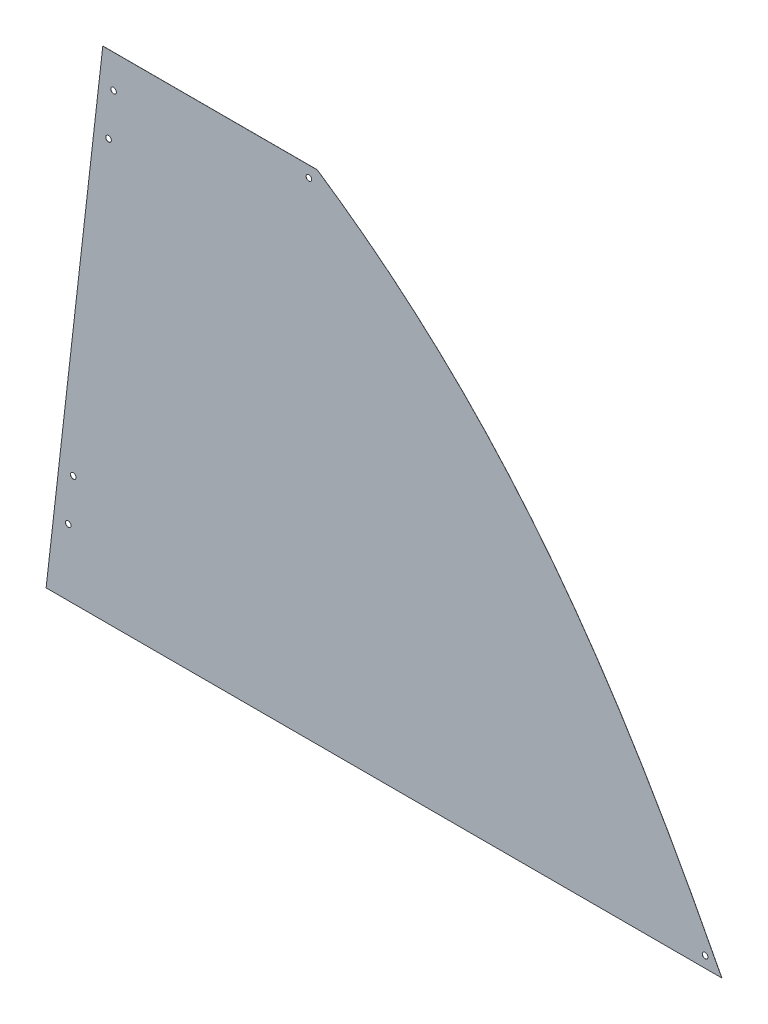
ISO-10303-21;
HEADER;
FILE_DESCRIPTION(('STEP AP214'),'2;1');
FILE_NAME('part.step','',(''),(''),'','','');
FILE_SCHEMA(('AUTOMOTIVE_DESIGN { 1 0 10303 214 1 1 1 1 }'));
ENDSEC;
DATA;
#1=APPLICATION_CONTEXT('core data for automotive mechanical design processes');
#2=APPLICATION_PROTOCOL_DEFINITION('international standard','automotive_design',2000,#1);
#3=PRODUCT_CONTEXT('',#1,'mechanical');
#4=PRODUCT('Part','Part','',(#3));
#5=PRODUCT_RELATED_PRODUCT_CATEGORY('part','',(#4));
#6=PRODUCT_DEFINITION_FORMATION('','',#4);
#7=PRODUCT_DEFINITION_CONTEXT('part definition',#1,'design');
#8=PRODUCT_DEFINITION('design','',#6,#7);
#9=PRODUCT_DEFINITION_SHAPE('','',#8);
#10=(LENGTH_UNIT() NAMED_UNIT(*) SI_UNIT(.MILLI.,.METRE.));
#11=(NAMED_UNIT(*) PLANE_ANGLE_UNIT() SI_UNIT($,.RADIAN.));
#12=(NAMED_UNIT(*) SI_UNIT($,.STERADIAN.) SOLID_ANGLE_UNIT());
#13=UNCERTAINTY_MEASURE_WITH_UNIT(LENGTH_MEASURE(1.E-05),#10,'distance_accuracy_value','');
#14=(GEOMETRIC_REPRESENTATION_CONTEXT(3) GLOBAL_UNCERTAINTY_ASSIGNED_CONTEXT((#13)) GLOBAL_UNIT_ASSIGNED_CONTEXT((#10,
#11,#12)) REPRESENTATION_CONTEXT('',''));
#15=CARTESIAN_POINT('',(0.,0.,0.));
#16=DIRECTION('',(0.,0.,1.));
#17=DIRECTION('',(1.,0.,0.));
#18=AXIS2_PLACEMENT_3D('',#15,#16,#17);
#19=CARTESIAN_POINT('',(546.176583356864,314.686016228379,0.));
#20=DIRECTION('',(0.,0.,1.));
#21=DIRECTION('',(1.,0.,0.));
#22=AXIS2_PLACEMENT_3D('',#19,#20,#21);
#23=PLANE('',#22);
#24=CARTESIAN_POINT('',(720.09,12.7,0.));
#25=DIRECTION('',(0.,0.,1.));
#26=DIRECTION('',(1.,0.,0.));
#27=AXIS2_PLACEMENT_3D('',#24,#25,#26);
#28=CIRCLE('',#27,3.17500000000004);
#29=CARTESIAN_POINT('',(723.265,12.7,0.));
#30=VERTEX_POINT('',#29);
#31=EDGE_CURVE('E149',#30,#30,#28,.T.);
#32=ORIENTED_EDGE('',*,*,#31,.T.);
#33=EDGE_LOOP('',(#32));
#34=FACE_BOUND('',#33,.T.);
#35=CARTESIAN_POINT('',(267.895636668357,555.12631551917,0.));
#36=DIRECTION('',(0.,0.,1.));
#37=DIRECTION('',(1.,0.,0.));
#38=AXIS2_PLACEMENT_3D('',#35,#36,#37);
#39=CIRCLE('',#38,3.17499999999998);
#40=CARTESIAN_POINT('',(271.070636668357,555.12631551917,0.));
#41=VERTEX_POINT('',#40);
#42=EDGE_CURVE('E159',#41,#41,#39,.T.);
#43=ORIENTED_EDGE('',*,*,#42,.T.);
#44=EDGE_LOOP('',(#43));
#45=FACE_BOUND('',#44,.T.);
#46=CARTESIAN_POINT('',(-0.961790577808013,126.183625670927,0.));
#47=DIRECTION('',(0.,0.,1.));
#48=DIRECTION('',(1.,0.,0.));
#49=AXIS2_PLACEMENT_3D('',#46,#47,#48);
#50=CIRCLE('',#49,3.17499999999999);
#51=CARTESIAN_POINT('',(2.21320942219198,126.183625670927,0.));
#52=VERTEX_POINT('',#51);
#53=EDGE_CURVE('E169',#52,#52,#50,.F.);
#54=ORIENTED_EDGE('',*,*,#53,.F.);
#55=EDGE_LOOP('',(#54));
#56=FACE_BOUND('',#55,.T.);
#57=CARTESIAN_POINT('',(39.2932722380583,479.497777549522,0.));
#58=DIRECTION('',(0.,0.,1.));
#59=DIRECTION('',(1.,0.,0.));
#60=AXIS2_PLACEMENT_3D('',#57,#58,#59);
#61=CIRCLE('',#60,3.17499999999999);
#62=CARTESIAN_POINT('',(42.4682722380583,479.497777549522,0.));
#63=VERTEX_POINT('',#62);
#64=EDGE_CURVE('E175',#63,#63,#61,.F.);
#65=ORIENTED_EDGE('',*,*,#64,.F.);
#66=EDGE_LOOP('',(#65));
#67=FACE_BOUND('',#66,.T.);
#68=CARTESIAN_POINT('',(45.0439954974677,529.971227817892,0.));
#69=DIRECTION('',(0.,0.,1.));
#70=DIRECTION('',(1.,0.,0.));
#71=AXIS2_PLACEMENT_3D('',#68,#69,#70);
#72=CIRCLE('',#71,3.17499999999999);
#73=CARTESIAN_POINT('',(48.2189954974677,529.971227817892,0.));
#74=VERTEX_POINT('',#73);
#75=EDGE_CURVE('E94',#74,#74,#72,.F.);
#76=ORIENTED_EDGE('',*,*,#75,.F.);
#77=EDGE_LOOP('',(#76));
#78=FACE_BOUND('',#77,.T.);
#79=DIRECTION('',(1.,0.,0.));
#80=VECTOR('',#79,1.);
#81=CARTESIAN_POINT('',(0.,0.,0.));
#82=LINE('',#81,#80);
#83=CARTESIAN_POINT('',(-31.9554140131912,0.,0.));
#84=VERTEX_POINT('',#83);
#85=CARTESIAN_POINT('',(739.14,0.,0.));
#86=VERTEX_POINT('',#85);
#87=EDGE_CURVE('E60',#84,#86,#82,.T.);
#88=ORIENTED_EDGE('',*,*,#87,.F.);
#89=DIRECTION('',(0.113203213767903,0.993571855676588,0.));
#90=VECTOR('',#89,1.);
#91=CARTESIAN_POINT('',(32.7402226551654,567.82631551917,0.));
#92=LINE('',#91,#90);
#93=CARTESIAN_POINT('',(32.7402226551654,567.82631551917,0.));
#94=VERTEX_POINT('',#93);
#95=EDGE_CURVE('E92',#84,#94,#92,.T.);
#96=ORIENTED_EDGE('',*,*,#95,.T.);
#97=DIRECTION('',(-1.,0.,0.));
#98=VECTOR('',#97,1.);
#99=CARTESIAN_POINT('',(64.6956366683566,567.82631551917,0.));
#100=LINE('',#99,#98);
#101=CARTESIAN_POINT('',(277.420636668357,567.82631551917,0.));
#102=VERTEX_POINT('',#101);
#103=EDGE_CURVE('E69',#102,#94,#100,.T.);
#104=ORIENTED_EDGE('',*,*,#103,.F.);
#105=CARTESIAN_POINT('',(739.14,0.,0.));
#106=CARTESIAN_POINT('',(620.758181584613,229.590161118797,0.));
#107=CARTESIAN_POINT('',(496.859161810905,420.297110317156,0.));
#108=CARTESIAN_POINT('',(277.420636668357,567.82631551917,0.));
#109=B_SPLINE_CURVE_WITH_KNOTS('',3,(#105,#106,#107,#108),.UNSPECIFIED.,.F.,.F.,(4,4),(0.,1.),.UNSPECIFIED.);
#110=EDGE_CURVE('E202',#86,#102,#109,.T.);
#111=ORIENTED_EDGE('',*,*,#110,.F.);
#112=EDGE_LOOP('',(#88,#96,#104,#111));
#113=FACE_BOUND('',#112,.T.);
#114=CARTESIAN_POINT('',(-6.71251383721748,75.710175402556,0.));
#115=DIRECTION('',(0.,0.,1.));
#116=DIRECTION('',(1.,0.,0.));
#117=AXIS2_PLACEMENT_3D('',#114,#115,#116);
#118=CIRCLE('',#117,3.17499999999999);
#119=CARTESIAN_POINT('',(-3.53751383721748,75.710175402556,0.));
#120=VERTEX_POINT('',#119);
#121=EDGE_CURVE('E163',#120,#120,#118,.F.);
#122=ORIENTED_EDGE('',*,*,#121,.F.);
#123=EDGE_LOOP('',(#122));
#124=FACE_BOUND('',#123,.T.);
#125=ADVANCED_FACE('F32',(#34,#45,#56,#67,#78,#113,#124),#23,.F.);
#126=CARTESIAN_POINT('',(0.,0.,0.127));
#127=DIRECTION('',(0.,1.,0.));
#128=DIRECTION('',(0.,0.,1.));
#129=AXIS2_PLACEMENT_3D('',#126,#127,#128);
#130=PLANE('',#129);
#131=ORIENTED_EDGE('',*,*,#87,.T.);
#132=DIRECTION('',(0.,0.,-1.));
#133=VECTOR('',#132,1.);
#134=CARTESIAN_POINT('',(739.14,0.,0.127));
#135=LINE('',#134,#133);
#136=CARTESIAN_POINT('',(739.14,0.,0.127));
#137=VERTEX_POINT('',#136);
#138=EDGE_CURVE('E11',#137,#86,#135,.T.);
#139=ORIENTED_EDGE('',*,*,#138,.F.);
#140=DIRECTION('',(1.,0.,0.));
#141=VECTOR('',#140,1.);
#142=CARTESIAN_POINT('',(0.,0.,0.127));
#143=LINE('',#142,#141);
#144=CARTESIAN_POINT('',(-31.9554140131912,0.,0.126999999999988));
#145=VERTEX_POINT('',#144);
#146=EDGE_CURVE('E79',#145,#137,#143,.T.);
#147=ORIENTED_EDGE('',*,*,#146,.F.);
#148=DIRECTION('',(0.,0.,-1.));
#149=VECTOR('',#148,1.);
#150=CARTESIAN_POINT('',(-31.9554140131912,0.,576.120185891919));
#151=LINE('',#150,#149);
#152=EDGE_CURVE('E81',#145,#84,#151,.T.);
#153=ORIENTED_EDGE('',*,*,#152,.T.);
#154=EDGE_LOOP('',(#131,#139,#147,#153));
#155=FACE_BOUND('',#154,.T.);
#156=ADVANCED_FACE('F34',(#155),#130,.F.);
#157=CARTESIAN_POINT('',(739.14,0.,0.127));
#158=CARTESIAN_POINT('',(620.758181584613,229.590161118797,0.127));
#159=CARTESIAN_POINT('',(496.859161810905,420.297110317156,0.127));
#160=CARTESIAN_POINT('',(277.420636668357,567.82631551917,0.127));
#161=B_SPLINE_CURVE_WITH_KNOTS('',3,(#157,#158,#159,#160),.UNSPECIFIED.,.F.,.F.,(4,4),(0.,1.),.UNSPECIFIED.);
#162=DIRECTION('',(0.,0.,-1.));
#163=VECTOR('',#162,1.);
#164=SURFACE_OF_LINEAR_EXTRUSION('',#161,#163);
#165=ORIENTED_EDGE('',*,*,#110,.T.);
#166=DIRECTION('',(0.,0.,-1.));
#167=VECTOR('',#166,1.);
#168=CARTESIAN_POINT('',(277.420636668357,567.82631551917,0.127));
#169=LINE('',#168,#167);
#170=CARTESIAN_POINT('',(277.420636668357,567.82631551917,0.127));
#171=VERTEX_POINT('',#170);
#172=EDGE_CURVE('E41',#171,#102,#169,.T.);
#173=ORIENTED_EDGE('',*,*,#172,.F.);
#174=EDGE_CURVE('E49',#137,#171,#161,.T.);
#175=ORIENTED_EDGE('',*,*,#174,.F.);
#176=ORIENTED_EDGE('',*,*,#138,.T.);
#177=EDGE_LOOP('',(#165,#173,#175,#176));
#178=FACE_BOUND('',#177,.T.);
#179=ADVANCED_FACE('F106',(#178),#164,.F.);
#180=CARTESIAN_POINT('',(64.6956366683566,567.82631551917,0.127));
#181=DIRECTION('',(0.,-1.,0.));
#182=DIRECTION('',(1.,0.,0.));
#183=AXIS2_PLACEMENT_3D('',#180,#181,#182);
#184=PLANE('',#183);
#185=ORIENTED_EDGE('',*,*,#103,.T.);
#186=DIRECTION('',(0.,0.,-1.));
#187=VECTOR('',#186,1.);
#188=CARTESIAN_POINT('',(32.7402226551654,567.82631551917,576.120185891919));
#189=LINE('',#188,#187);
#190=CARTESIAN_POINT('',(32.7402226551654,567.82631551917,0.126999999999988));
#191=VERTEX_POINT('',#190);
#192=EDGE_CURVE('E88',#191,#94,#189,.T.);
#193=ORIENTED_EDGE('',*,*,#192,.F.);
#194=DIRECTION('',(-1.,0.,0.));
#195=VECTOR('',#194,1.);
#196=CARTESIAN_POINT('',(64.6956366683566,567.82631551917,0.127));
#197=LINE('',#196,#195);
#198=EDGE_CURVE('E77',#171,#191,#197,.T.);
#199=ORIENTED_EDGE('',*,*,#198,.F.);
#200=ORIENTED_EDGE('',*,*,#172,.T.);
#201=EDGE_LOOP('',(#185,#193,#199,#200));
#202=FACE_BOUND('',#201,.T.);
#203=ADVANCED_FACE('F109',(#202),#184,.F.);
#204=CARTESIAN_POINT('',(546.176583356864,314.686016228379,0.127));
#205=DIRECTION('',(0.,0.,1.));
#206=DIRECTION('',(1.,0.,0.));
#207=AXIS2_PLACEMENT_3D('',#204,#205,#206);
#208=PLANE('',#207);
#209=CARTESIAN_POINT('',(720.09,12.7,0.127000000000001));
#210=DIRECTION('',(0.,0.,1.));
#211=DIRECTION('',(1.,0.,0.));
#212=AXIS2_PLACEMENT_3D('',#209,#210,#211);
#213=CIRCLE('',#212,3.17500000000004);
#214=CARTESIAN_POINT('',(723.265,12.7,0.127000000000001));
#215=VERTEX_POINT('',#214);
#216=EDGE_CURVE('E152',#215,#215,#213,.T.);
#217=ORIENTED_EDGE('',*,*,#216,.F.);
#218=EDGE_LOOP('',(#217));
#219=FACE_BOUND('',#218,.T.);
#220=CARTESIAN_POINT('',(267.895636668357,555.12631551917,0.127000000000001));
#221=DIRECTION('',(0.,0.,1.));
#222=DIRECTION('',(1.,0.,0.));
#223=AXIS2_PLACEMENT_3D('',#220,#221,#222);
#224=CIRCLE('',#223,3.17499999999998);
#225=CARTESIAN_POINT('',(271.070636668357,555.12631551917,0.127000000000001));
#226=VERTEX_POINT('',#225);
#227=EDGE_CURVE('E154',#226,#226,#224,.T.);
#228=ORIENTED_EDGE('',*,*,#227,.F.);
#229=EDGE_LOOP('',(#228));
#230=FACE_BOUND('',#229,.T.);
#231=CARTESIAN_POINT('',(-6.71251383721748,75.710175402556,0.127000000000001));
#232=DIRECTION('',(0.,0.,1.));
#233=DIRECTION('',(1.,0.,0.));
#234=AXIS2_PLACEMENT_3D('',#231,#232,#233);
#235=CIRCLE('',#234,3.17499999999999);
#236=CARTESIAN_POINT('',(-3.53751383721749,75.710175402556,0.127000000000001));
#237=VERTEX_POINT('',#236);
#238=EDGE_CURVE('E162',#237,#237,#235,.T.);
#239=ORIENTED_EDGE('',*,*,#238,.F.);
#240=EDGE_LOOP('',(#239));
#241=FACE_BOUND('',#240,.T.);
#242=CARTESIAN_POINT('',(-0.961790577808013,126.183625670927,0.127000000000001));
#243=DIRECTION('',(0.,0.,1.));
#244=DIRECTION('',(1.,0.,0.));
#245=AXIS2_PLACEMENT_3D('',#242,#243,#244);
#246=CIRCLE('',#245,3.17499999999999);
#247=CARTESIAN_POINT('',(2.21320942219198,126.183625670927,0.127000000000001));
#248=VERTEX_POINT('',#247);
#249=EDGE_CURVE('E166',#248,#248,#246,.T.);
#250=ORIENTED_EDGE('',*,*,#249,.F.);
#251=EDGE_LOOP('',(#250));
#252=FACE_BOUND('',#251,.T.);
#253=CARTESIAN_POINT('',(39.2932722380583,479.497777549522,0.127000000000001));
#254=DIRECTION('',(0.,0.,1.));
#255=DIRECTION('',(1.,0.,0.));
#256=AXIS2_PLACEMENT_3D('',#253,#254,#255);
#257=CIRCLE('',#256,3.17499999999999);
#258=CARTESIAN_POINT('',(42.4682722380583,479.497777549522,0.127000000000001));
#259=VERTEX_POINT('',#258);
#260=EDGE_CURVE('E172',#259,#259,#257,.T.);
#261=ORIENTED_EDGE('',*,*,#260,.F.);
#262=EDGE_LOOP('',(#261));
#263=FACE_BOUND('',#262,.T.);
#264=CARTESIAN_POINT('',(45.0439954974677,529.971227817892,0.127000000000001));
#265=DIRECTION('',(0.,0.,1.));
#266=DIRECTION('',(1.,0.,0.));
#267=AXIS2_PLACEMENT_3D('',#264,#265,#266);
#268=CIRCLE('',#267,3.17499999999999);
#269=CARTESIAN_POINT('',(48.2189954974677,529.971227817892,0.127000000000001));
#270=VERTEX_POINT('',#269);
#271=EDGE_CURVE('E178',#270,#270,#268,.T.);
#272=ORIENTED_EDGE('',*,*,#271,.F.);
#273=EDGE_LOOP('',(#272));
#274=FACE_BOUND('',#273,.T.);
#275=ORIENTED_EDGE('',*,*,#198,.T.);
#276=DIRECTION('',(0.113203213767903,0.993571855676588,0.));
#277=VECTOR('',#276,1.);
#278=CARTESIAN_POINT('',(32.7402226551654,567.82631551917,0.126999999999988));
#279=LINE('',#278,#277);
#280=EDGE_CURVE('E85',#145,#191,#279,.T.);
#281=ORIENTED_EDGE('',*,*,#280,.F.);
#282=ORIENTED_EDGE('',*,*,#146,.T.);
#283=ORIENTED_EDGE('',*,*,#174,.T.);
#284=EDGE_LOOP('',(#275,#281,#282,#283));
#285=FACE_BOUND('',#284,.T.);
#286=ADVANCED_FACE('F86',(#219,#230,#241,#252,#263,#274,#285),#208,.T.);
#287=CARTESIAN_POINT('',(32.7402226551654,567.82631551917,576.120185891919));
#288=DIRECTION('',(-0.993571855676588,0.113203213767903,0.));
#289=DIRECTION('',(-0.113203213767903,-0.993571855676588,0.));
#290=AXIS2_PLACEMENT_3D('',#287,#288,#289);
#291=PLANE('',#290);
#292=ORIENTED_EDGE('',*,*,#152,.F.);
#293=ORIENTED_EDGE('',*,*,#280,.T.);
#294=ORIENTED_EDGE('',*,*,#192,.T.);
#295=ORIENTED_EDGE('',*,*,#95,.F.);
#296=EDGE_LOOP('',(#292,#293,#294,#295));
#297=FACE_BOUND('',#296,.T.);
#298=ADVANCED_FACE('F90',(#297),#291,.T.);
#299=CARTESIAN_POINT('',(45.0439954974677,529.971227817892,0.127));
#300=DIRECTION('',(0.,0.,1.));
#301=DIRECTION('',(1.,0.,0.));
#302=AXIS2_PLACEMENT_3D('',#299,#300,#301);
#303=CYLINDRICAL_SURFACE('',#302,3.17499999999999);
#304=ORIENTED_EDGE('',*,*,#75,.T.);
#305=EDGE_LOOP('',(#304));
#306=FACE_BOUND('',#305,.T.);
#307=ORIENTED_EDGE('',*,*,#271,.T.);
#308=EDGE_LOOP('',(#307));
#309=FACE_BOUND('',#308,.T.);
#310=ADVANCED_FACE('F121',(#306,#309),#303,.F.);
#311=CARTESIAN_POINT('',(39.2932722380583,479.497777549522,0.127));
#312=DIRECTION('',(0.,0.,1.));
#313=DIRECTION('',(1.,0.,0.));
#314=AXIS2_PLACEMENT_3D('',#311,#312,#313);
#315=CYLINDRICAL_SURFACE('',#314,3.17499999999999);
#316=ORIENTED_EDGE('',*,*,#64,.T.);
#317=EDGE_LOOP('',(#316));
#318=FACE_BOUND('',#317,.T.);
#319=ORIENTED_EDGE('',*,*,#260,.T.);
#320=EDGE_LOOP('',(#319));
#321=FACE_BOUND('',#320,.T.);
#322=ADVANCED_FACE('F124',(#318,#321),#315,.F.);
#323=CARTESIAN_POINT('',(-0.961790577808013,126.183625670927,0.127));
#324=DIRECTION('',(0.,0.,1.));
#325=DIRECTION('',(1.,0.,0.));
#326=AXIS2_PLACEMENT_3D('',#323,#324,#325);
#327=CYLINDRICAL_SURFACE('',#326,3.17499999999999);
#328=ORIENTED_EDGE('',*,*,#53,.T.);
#329=EDGE_LOOP('',(#328));
#330=FACE_BOUND('',#329,.T.);
#331=ORIENTED_EDGE('',*,*,#249,.T.);
#332=EDGE_LOOP('',(#331));
#333=FACE_BOUND('',#332,.T.);
#334=ADVANCED_FACE('F128',(#330,#333),#327,.F.);
#335=CARTESIAN_POINT('',(-6.71251383721748,75.710175402556,0.127));
#336=DIRECTION('',(0.,0.,1.));
#337=DIRECTION('',(1.,0.,0.));
#338=AXIS2_PLACEMENT_3D('',#335,#336,#337);
#339=CYLINDRICAL_SURFACE('',#338,3.17499999999999);
#340=ORIENTED_EDGE('',*,*,#121,.T.);
#341=EDGE_LOOP('',(#340));
#342=FACE_BOUND('',#341,.T.);
#343=ORIENTED_EDGE('',*,*,#238,.T.);
#344=EDGE_LOOP('',(#343));
#345=FACE_BOUND('',#344,.T.);
#346=ADVANCED_FACE('F132',(#342,#345),#339,.F.);
#347=CARTESIAN_POINT('',(267.895636668357,555.12631551917,0.127));
#348=DIRECTION('',(0.,0.,1.));
#349=DIRECTION('',(1.,0.,0.));
#350=AXIS2_PLACEMENT_3D('',#347,#348,#349);
#351=CYLINDRICAL_SURFACE('',#350,3.17499999999998);
#352=ORIENTED_EDGE('',*,*,#42,.F.);
#353=EDGE_LOOP('',(#352));
#354=FACE_BOUND('',#353,.T.);
#355=ORIENTED_EDGE('',*,*,#227,.T.);
#356=EDGE_LOOP('',(#355));
#357=FACE_BOUND('',#356,.T.);
#358=ADVANCED_FACE('F136',(#354,#357),#351,.F.);
#359=CARTESIAN_POINT('',(720.09,12.7,0.127));
#360=DIRECTION('',(0.,0.,1.));
#361=DIRECTION('',(1.,0.,0.));
#362=AXIS2_PLACEMENT_3D('',#359,#360,#361);
#363=CYLINDRICAL_SURFACE('',#362,3.17500000000004);
#364=ORIENTED_EDGE('',*,*,#31,.F.);
#365=EDGE_LOOP('',(#364));
#366=FACE_BOUND('',#365,.T.);
#367=ORIENTED_EDGE('',*,*,#216,.T.);
#368=EDGE_LOOP('',(#367));
#369=FACE_BOUND('',#368,.T.);
#370=ADVANCED_FACE('F140',(#366,#369),#363,.F.);
#371=CLOSED_SHELL('',(#125,#156,#179,#203,#286,#298,#310,#322,#334,#346,#358,#370));
#372=MANIFOLD_SOLID_BREP('B2',#371);
#373=ADVANCED_BREP_SHAPE_REPRESENTATION('',(#18,#372),#14);
#374=SHAPE_DEFINITION_REPRESENTATION(#9,#373);
ENDSEC;
END-ISO-10303-21;
